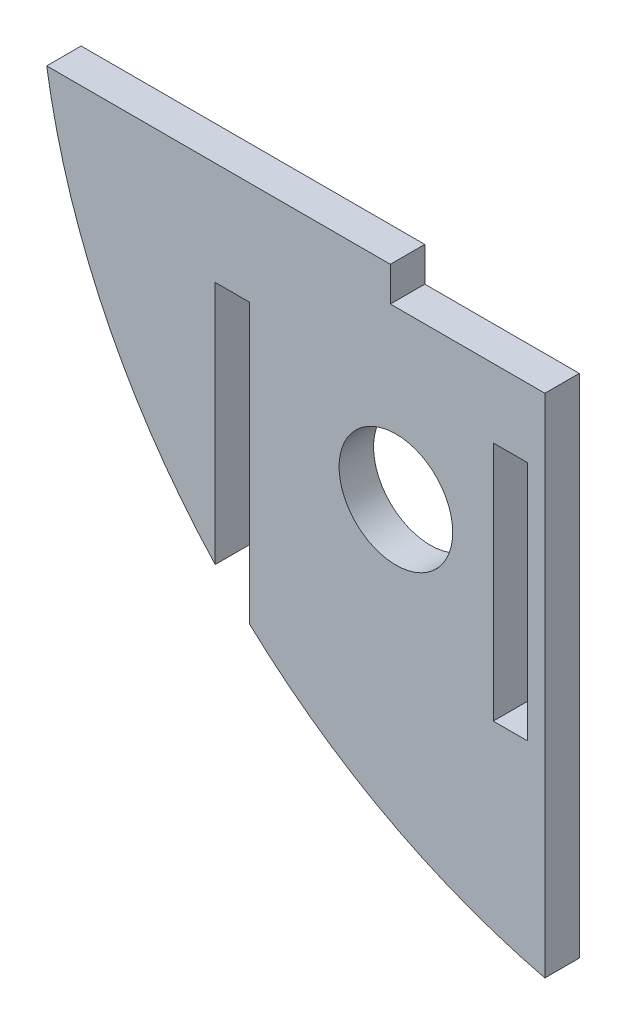
ISO-10303-21;
HEADER;
FILE_DESCRIPTION(('STEP AP214'),'2;1');
FILE_NAME('part.step','',(''),(''),'','','');
FILE_SCHEMA(('AUTOMOTIVE_DESIGN { 1 0 10303 214 1 1 1 1 }'));
ENDSEC;
DATA;
#1=APPLICATION_CONTEXT('core data for automotive mechanical design processes');
#2=APPLICATION_PROTOCOL_DEFINITION('international standard','automotive_design',2000,#1);
#3=PRODUCT_CONTEXT('',#1,'mechanical');
#4=PRODUCT('Part','Part','',(#3));
#5=PRODUCT_RELATED_PRODUCT_CATEGORY('part','',(#4));
#6=PRODUCT_DEFINITION_FORMATION('','',#4);
#7=PRODUCT_DEFINITION_CONTEXT('part definition',#1,'design');
#8=PRODUCT_DEFINITION('design','',#6,#7);
#9=PRODUCT_DEFINITION_SHAPE('','',#8);
#10=(LENGTH_UNIT() NAMED_UNIT(*) SI_UNIT(.MILLI.,.METRE.));
#11=(NAMED_UNIT(*) PLANE_ANGLE_UNIT() SI_UNIT($,.RADIAN.));
#12=(NAMED_UNIT(*) SI_UNIT($,.STERADIAN.) SOLID_ANGLE_UNIT());
#13=UNCERTAINTY_MEASURE_WITH_UNIT(LENGTH_MEASURE(1.E-05),#10,'distance_accuracy_value','');
#14=(GEOMETRIC_REPRESENTATION_CONTEXT(3) GLOBAL_UNCERTAINTY_ASSIGNED_CONTEXT((#13)) GLOBAL_UNIT_ASSIGNED_CONTEXT((#10,
#11,#12)) REPRESENTATION_CONTEXT('',''));
#15=CARTESIAN_POINT('',(0.,0.,0.));
#16=DIRECTION('',(0.,0.,1.));
#17=DIRECTION('',(1.,0.,0.));
#18=AXIS2_PLACEMENT_3D('',#15,#16,#17);
#19=CARTESIAN_POINT('',(6.93769018271361,21.6543137833322,2.));
#20=DIRECTION('',(0.,0.,1.));
#21=DIRECTION('',(1.,0.,0.));
#22=AXIS2_PLACEMENT_3D('',#19,#20,#21);
#23=PLANE('',#22);
#24=CARTESIAN_POINT('',(-10.7533590556281,4.0363965742915,2.));
#25=DIRECTION('',(0.,0.,1.));
#26=DIRECTION('',(1.,0.,0.));
#27=AXIS2_PLACEMENT_3D('',#24,#25,#26);
#28=CIRCLE('',#27,3.3);
#29=CARTESIAN_POINT('',(-7.45335905562809,4.0363965742915,2.));
#30=VERTEX_POINT('',#29);
#31=EDGE_CURVE('E163',#30,#30,#28,.T.);
#32=ORIENTED_EDGE('',*,*,#31,.F.);
#33=EDGE_LOOP('',(#32));
#34=FACE_BOUND('',#33,.T.);
#35=DIRECTION('',(1.,0.,0.));
#36=VECTOR('',#35,1.);
#37=CARTESIAN_POINT('',(-19.2533590556282,9.71406610395515,2.));
#38=LINE('',#37,#36);
#39=CARTESIAN_POINT('',(-21.2533590556282,9.71406610395515,2.));
#40=VERTEX_POINT('',#39);
#41=CARTESIAN_POINT('',(-19.2533590556282,9.71406610395515,2.));
#42=VERTEX_POINT('',#41);
#43=EDGE_CURVE('E169',#40,#42,#38,.T.);
#44=ORIENTED_EDGE('',*,*,#43,.T.);
#45=DIRECTION('',(0.,-1.,0.));
#46=VECTOR('',#45,1.);
#47=CARTESIAN_POINT('',(-19.2533590556282,9.71406610395515,2.));
#48=LINE('',#47,#46);
#49=CARTESIAN_POINT('',(-19.2533590556282,-6.48909148240628,2.));
#50=VERTEX_POINT('',#49);
#51=EDGE_CURVE('E172',#42,#50,#48,.T.);
#52=ORIENTED_EDGE('',*,*,#51,.T.);
#53=CARTESIAN_POINT('',(6.93769018271361,21.6543137833322,2.));
#54=DIRECTION('',(0.,0.,1.));
#55=DIRECTION('',(1.,0.,0.));
#56=AXIS2_PLACEMENT_3D('',#53,#54,#55);
#57=CIRCLE('',#56,38.4450558610186);
#58=CARTESIAN_POINT('',(-2.09704859359963,-15.7140661039551,2.));
#59=VERTEX_POINT('',#58);
#60=EDGE_CURVE('E175',#50,#59,#57,.T.);
#61=ORIENTED_EDGE('',*,*,#60,.T.);
#62=DIRECTION('',(0.,1.,0.));
#63=VECTOR('',#62,1.);
#64=CARTESIAN_POINT('',(-2.0970485935996,-15.7140661039551,2.));
#65=LINE('',#64,#63);
#66=CARTESIAN_POINT('',(-2.0970485935996,13.7140661039551,2.));
#67=VERTEX_POINT('',#66);
#68=EDGE_CURVE('E177',#59,#67,#65,.T.);
#69=ORIENTED_EDGE('',*,*,#68,.T.);
#70=DIRECTION('',(-1.,0.,0.));
#71=VECTOR('',#70,1.);
#72=CARTESIAN_POINT('',(-11.0756895259615,13.7140661039551,2.));
#73=LINE('',#72,#71);
#74=CARTESIAN_POINT('',(-11.0756895259615,13.7140661039551,2.));
#75=VERTEX_POINT('',#74);
#76=EDGE_CURVE('E179',#67,#75,#73,.T.);
#77=ORIENTED_EDGE('',*,*,#76,.T.);
#78=DIRECTION('',(0.,1.,0.));
#79=VECTOR('',#78,1.);
#80=CARTESIAN_POINT('',(-11.0756895259615,13.7140661039551,2.));
#81=LINE('',#80,#79);
#82=CARTESIAN_POINT('',(-11.0756895259615,15.7140661039551,2.));
#83=VERTEX_POINT('',#82);
#84=EDGE_CURVE('E181',#75,#83,#81,.T.);
#85=ORIENTED_EDGE('',*,*,#84,.T.);
#86=DIRECTION('',(-1.,0.,0.));
#87=VECTOR('',#86,1.);
#88=CARTESIAN_POINT('',(-11.0756895259615,15.7140661039551,2.));
#89=LINE('',#88,#87);
#90=CARTESIAN_POINT('',(-31.0456716703991,15.7140661039551,2.));
#91=VERTEX_POINT('',#90);
#92=EDGE_CURVE('E183',#83,#91,#89,.T.);
#93=ORIENTED_EDGE('',*,*,#92,.T.);
#94=CARTESIAN_POINT('',(6.93769018271361,21.6543137833322,2.));
#95=DIRECTION('',(0.,0.,1.));
#96=DIRECTION('',(1.,0.,0.));
#97=AXIS2_PLACEMENT_3D('',#94,#95,#96);
#98=CIRCLE('',#97,38.4450558610186);
#99=CARTESIAN_POINT('',(-21.2533590556282,-4.48544641063722,2.));
#100=VERTEX_POINT('',#99);
#101=EDGE_CURVE('E185',#91,#100,#98,.T.);
#102=ORIENTED_EDGE('',*,*,#101,.T.);
#103=DIRECTION('',(0.,1.,0.));
#104=VECTOR('',#103,1.);
#105=CARTESIAN_POINT('',(-21.2533590556282,9.71406610395515,2.));
#106=LINE('',#105,#104);
#107=EDGE_CURVE('E187',#100,#40,#106,.T.);
#108=ORIENTED_EDGE('',*,*,#107,.T.);
#109=EDGE_LOOP('',(#44,#52,#61,#69,#77,#85,#93,#102,#108));
#110=FACE_BOUND('',#109,.T.);
#111=DIRECTION('',(0.,-1.,0.));
#112=VECTOR('',#111,1.);
#113=CARTESIAN_POINT('',(-5.09704859360113,-4.28593389604486,2.));
#114=LINE('',#113,#112);
#115=CARTESIAN_POINT('',(-5.09704859360113,9.71406610395515,2.));
#116=VERTEX_POINT('',#115);
#117=CARTESIAN_POINT('',(-5.09704859360113,-4.28593389604486,2.));
#118=VERTEX_POINT('',#117);
#119=EDGE_CURVE('E135',#116,#118,#114,.T.);
#120=ORIENTED_EDGE('',*,*,#119,.F.);
#121=DIRECTION('',(-1.,0.,0.));
#122=VECTOR('',#121,1.);
#123=CARTESIAN_POINT('',(-3.09704859360113,9.71406610395515,2.));
#124=LINE('',#123,#122);
#125=CARTESIAN_POINT('',(-3.09704859360113,9.71406610395515,2.));
#126=VERTEX_POINT('',#125);
#127=EDGE_CURVE('E127',#126,#116,#124,.T.);
#128=ORIENTED_EDGE('',*,*,#127,.F.);
#129=DIRECTION('',(0.,1.,0.));
#130=VECTOR('',#129,1.);
#131=CARTESIAN_POINT('',(-3.09704859360113,-4.28593389604486,2.));
#132=LINE('',#131,#130);
#133=CARTESIAN_POINT('',(-3.09704859360113,-4.28593389604486,2.));
#134=VERTEX_POINT('',#133);
#135=EDGE_CURVE('E149',#134,#126,#132,.T.);
#136=ORIENTED_EDGE('',*,*,#135,.F.);
#137=DIRECTION('',(1.,0.,0.));
#138=VECTOR('',#137,1.);
#139=CARTESIAN_POINT('',(-5.09704859360113,-4.28593389604486,2.));
#140=LINE('',#139,#138);
#141=EDGE_CURVE('E147',#118,#134,#140,.T.);
#142=ORIENTED_EDGE('',*,*,#141,.F.);
#143=EDGE_LOOP('',(#120,#128,#136,#142));
#144=FACE_BOUND('',#143,.T.);
#145=ADVANCED_FACE('F32',(#34,#110,#144),#23,.T.);
#146=CARTESIAN_POINT('',(6.93769018271361,21.6543137833322,0.));
#147=DIRECTION('',(0.,0.,1.));
#148=DIRECTION('',(1.,0.,0.));
#149=AXIS2_PLACEMENT_3D('',#146,#147,#148);
#150=PLANE('',#149);
#151=CARTESIAN_POINT('',(-10.7533590556281,4.0363965742915,0.));
#152=DIRECTION('',(0.,0.,1.));
#153=DIRECTION('',(1.,0.,0.));
#154=AXIS2_PLACEMENT_3D('',#151,#152,#153);
#155=CIRCLE('',#154,3.3);
#156=CARTESIAN_POINT('',(-7.45335905562809,4.0363965742915,0.));
#157=VERTEX_POINT('',#156);
#158=EDGE_CURVE('E143',#157,#157,#155,.T.);
#159=ORIENTED_EDGE('',*,*,#158,.T.);
#160=EDGE_LOOP('',(#159));
#161=FACE_BOUND('',#160,.T.);
#162=DIRECTION('',(1.,0.,0.));
#163=VECTOR('',#162,1.);
#164=CARTESIAN_POINT('',(-19.2533590556282,9.71406610395515,0.));
#165=LINE('',#164,#163);
#166=CARTESIAN_POINT('',(-21.2533590556282,9.71406610395515,0.));
#167=VERTEX_POINT('',#166);
#168=CARTESIAN_POINT('',(-19.2533590556282,9.71406610395515,0.));
#169=VERTEX_POINT('',#168);
#170=EDGE_CURVE('E166',#167,#169,#165,.T.);
#171=ORIENTED_EDGE('',*,*,#170,.F.);
#172=DIRECTION('',(0.,1.,0.));
#173=VECTOR('',#172,1.);
#174=CARTESIAN_POINT('',(-21.2533590556282,9.71406610395515,0.));
#175=LINE('',#174,#173);
#176=CARTESIAN_POINT('',(-21.2533590556282,-4.48544641063722,0.));
#177=VERTEX_POINT('',#176);
#178=EDGE_CURVE('E173',#177,#167,#175,.T.);
#179=ORIENTED_EDGE('',*,*,#178,.F.);
#180=CARTESIAN_POINT('',(6.93769018271361,21.6543137833322,0.));
#181=DIRECTION('',(0.,0.,1.));
#182=DIRECTION('',(1.,0.,0.));
#183=AXIS2_PLACEMENT_3D('',#180,#181,#182);
#184=CIRCLE('',#183,38.4450558610186);
#185=CARTESIAN_POINT('',(-31.0456716703991,15.7140661039551,0.));
#186=VERTEX_POINT('',#185);
#187=EDGE_CURVE('E204',#186,#177,#184,.T.);
#188=ORIENTED_EDGE('',*,*,#187,.F.);
#189=DIRECTION('',(-1.,0.,0.));
#190=VECTOR('',#189,1.);
#191=CARTESIAN_POINT('',(-11.0756895259615,15.7140661039551,0.));
#192=LINE('',#191,#190);
#193=CARTESIAN_POINT('',(-11.0756895259615,15.7140661039551,0.));
#194=VERTEX_POINT('',#193);
#195=EDGE_CURVE('E202',#194,#186,#192,.T.);
#196=ORIENTED_EDGE('',*,*,#195,.F.);
#197=DIRECTION('',(0.,1.,0.));
#198=VECTOR('',#197,1.);
#199=CARTESIAN_POINT('',(-11.0756895259615,13.7140661039551,0.));
#200=LINE('',#199,#198);
#201=CARTESIAN_POINT('',(-11.0756895259615,13.7140661039551,0.));
#202=VERTEX_POINT('',#201);
#203=EDGE_CURVE('E200',#202,#194,#200,.T.);
#204=ORIENTED_EDGE('',*,*,#203,.F.);
#205=DIRECTION('',(-1.,0.,0.));
#206=VECTOR('',#205,1.);
#207=CARTESIAN_POINT('',(-11.0756895259615,13.7140661039551,0.));
#208=LINE('',#207,#206);
#209=CARTESIAN_POINT('',(-2.0970485935996,13.7140661039551,0.));
#210=VERTEX_POINT('',#209);
#211=EDGE_CURVE('E198',#210,#202,#208,.T.);
#212=ORIENTED_EDGE('',*,*,#211,.F.);
#213=DIRECTION('',(0.,1.,0.));
#214=VECTOR('',#213,1.);
#215=CARTESIAN_POINT('',(-2.0970485935996,-15.7140661039551,0.));
#216=LINE('',#215,#214);
#217=CARTESIAN_POINT('',(-2.09704859359963,-15.7140661039551,0.));
#218=VERTEX_POINT('',#217);
#219=EDGE_CURVE('E196',#218,#210,#216,.T.);
#220=ORIENTED_EDGE('',*,*,#219,.F.);
#221=CARTESIAN_POINT('',(6.93769018271361,21.6543137833322,0.));
#222=DIRECTION('',(0.,0.,1.));
#223=DIRECTION('',(1.,0.,0.));
#224=AXIS2_PLACEMENT_3D('',#221,#222,#223);
#225=CIRCLE('',#224,38.4450558610186);
#226=CARTESIAN_POINT('',(-19.2533590556282,-6.48909148240628,0.));
#227=VERTEX_POINT('',#226);
#228=EDGE_CURVE('E194',#227,#218,#225,.T.);
#229=ORIENTED_EDGE('',*,*,#228,.F.);
#230=DIRECTION('',(0.,-1.,0.));
#231=VECTOR('',#230,1.);
#232=CARTESIAN_POINT('',(-19.2533590556282,9.71406610395515,0.));
#233=LINE('',#232,#231);
#234=EDGE_CURVE('E192',#169,#227,#233,.T.);
#235=ORIENTED_EDGE('',*,*,#234,.F.);
#236=EDGE_LOOP('',(#171,#179,#188,#196,#204,#212,#220,#229,#235));
#237=FACE_BOUND('',#236,.T.);
#238=DIRECTION('',(-1.,0.,0.));
#239=VECTOR('',#238,1.);
#240=CARTESIAN_POINT('',(-3.09704859360113,9.71406610395515,0.));
#241=LINE('',#240,#239);
#242=CARTESIAN_POINT('',(-3.09704859360113,9.71406610395515,0.));
#243=VERTEX_POINT('',#242);
#244=CARTESIAN_POINT('',(-5.09704859360113,9.71406610395515,0.));
#245=VERTEX_POINT('',#244);
#246=EDGE_CURVE('E55',#243,#245,#241,.T.);
#247=ORIENTED_EDGE('',*,*,#246,.T.);
#248=DIRECTION('',(0.,-1.,0.));
#249=VECTOR('',#248,1.);
#250=CARTESIAN_POINT('',(-5.09704859360113,-4.28593389604486,0.));
#251=LINE('',#250,#249);
#252=CARTESIAN_POINT('',(-5.09704859360113,-4.28593389604486,0.));
#253=VERTEX_POINT('',#252);
#254=EDGE_CURVE('E142',#245,#253,#251,.T.);
#255=ORIENTED_EDGE('',*,*,#254,.T.);
#256=DIRECTION('',(1.,0.,0.));
#257=VECTOR('',#256,1.);
#258=CARTESIAN_POINT('',(-5.09704859360113,-4.28593389604486,0.));
#259=LINE('',#258,#257);
#260=CARTESIAN_POINT('',(-3.09704859360113,-4.28593389604486,0.));
#261=VERTEX_POINT('',#260);
#262=EDGE_CURVE('E155',#253,#261,#259,.T.);
#263=ORIENTED_EDGE('',*,*,#262,.T.);
#264=DIRECTION('',(0.,1.,0.));
#265=VECTOR('',#264,1.);
#266=CARTESIAN_POINT('',(-3.09704859360113,-4.28593389604486,0.));
#267=LINE('',#266,#265);
#268=EDGE_CURVE('E136',#261,#243,#267,.T.);
#269=ORIENTED_EDGE('',*,*,#268,.T.);
#270=EDGE_LOOP('',(#247,#255,#263,#269));
#271=FACE_BOUND('',#270,.T.);
#272=ADVANCED_FACE('F237',(#161,#237,#271),#150,.F.);
#273=CARTESIAN_POINT('',(-19.2533590556282,9.71406610395515,2.));
#274=DIRECTION('',(0.,1.,0.));
#275=DIRECTION('',(0.,0.,1.));
#276=AXIS2_PLACEMENT_3D('',#273,#274,#275);
#277=PLANE('',#276);
#278=ORIENTED_EDGE('',*,*,#170,.T.);
#279=DIRECTION('',(0.,0.,-1.));
#280=VECTOR('',#279,1.);
#281=CARTESIAN_POINT('',(-19.2533590556282,9.71406610395515,2.));
#282=LINE('',#281,#280);
#283=EDGE_CURVE('E11',#42,#169,#282,.T.);
#284=ORIENTED_EDGE('',*,*,#283,.F.);
#285=ORIENTED_EDGE('',*,*,#43,.F.);
#286=DIRECTION('',(0.,0.,-1.));
#287=VECTOR('',#286,1.);
#288=CARTESIAN_POINT('',(-21.2533590556282,9.71406610395515,2.));
#289=LINE('',#288,#287);
#290=EDGE_CURVE('E189',#40,#167,#289,.T.);
#291=ORIENTED_EDGE('',*,*,#290,.T.);
#292=EDGE_LOOP('',(#278,#284,#285,#291));
#293=FACE_BOUND('',#292,.T.);
#294=ADVANCED_FACE('F34',(#293),#277,.F.);
#295=CARTESIAN_POINT('',(-19.2533590556282,9.71406610395515,2.));
#296=DIRECTION('',(1.,0.,0.));
#297=DIRECTION('',(0.,0.,-1.));
#298=AXIS2_PLACEMENT_3D('',#295,#296,#297);
#299=PLANE('',#298);
#300=ORIENTED_EDGE('',*,*,#234,.T.);
#301=DIRECTION('',(0.,0.,-1.));
#302=VECTOR('',#301,1.);
#303=CARTESIAN_POINT('',(-19.2533590556282,-6.48909148240628,2.));
#304=LINE('',#303,#302);
#305=EDGE_CURVE('E40',#50,#227,#304,.T.);
#306=ORIENTED_EDGE('',*,*,#305,.F.);
#307=ORIENTED_EDGE('',*,*,#51,.F.);
#308=ORIENTED_EDGE('',*,*,#283,.T.);
#309=EDGE_LOOP('',(#300,#306,#307,#308));
#310=FACE_BOUND('',#309,.T.);
#311=ADVANCED_FACE('F254',(#310),#299,.F.);
#312=CARTESIAN_POINT('',(6.93769018271361,21.6543137833322,2.));
#313=DIRECTION('',(0.,0.,-1.));
#314=DIRECTION('',(-1.,0.,0.));
#315=AXIS2_PLACEMENT_3D('',#312,#313,#314);
#316=CYLINDRICAL_SURFACE('',#315,38.4450558610186);
#317=ORIENTED_EDGE('',*,*,#228,.T.);
#318=DIRECTION('',(0.,0.,-1.));
#319=VECTOR('',#318,1.);
#320=CARTESIAN_POINT('',(-2.09704859359963,-15.7140661039551,2.));
#321=LINE('',#320,#319);
#322=EDGE_CURVE('E224',#59,#218,#321,.T.);
#323=ORIENTED_EDGE('',*,*,#322,.F.);
#324=ORIENTED_EDGE('',*,*,#60,.F.);
#325=ORIENTED_EDGE('',*,*,#305,.T.);
#326=EDGE_LOOP('',(#317,#323,#324,#325));
#327=FACE_BOUND('',#326,.T.);
#328=ADVANCED_FACE('F231',(#327),#316,.T.);
#329=CARTESIAN_POINT('',(-2.0970485935996,-15.7140661039551,2.));
#330=DIRECTION('',(-1.,0.,0.));
#331=DIRECTION('',(0.,0.,1.));
#332=AXIS2_PLACEMENT_3D('',#329,#330,#331);
#333=PLANE('',#332);
#334=ORIENTED_EDGE('',*,*,#219,.T.);
#335=DIRECTION('',(0.,0.,-1.));
#336=VECTOR('',#335,1.);
#337=CARTESIAN_POINT('',(-2.0970485935996,13.7140661039551,2.));
#338=LINE('',#337,#336);
#339=EDGE_CURVE('E221',#67,#210,#338,.T.);
#340=ORIENTED_EDGE('',*,*,#339,.F.);
#341=ORIENTED_EDGE('',*,*,#68,.F.);
#342=ORIENTED_EDGE('',*,*,#322,.T.);
#343=EDGE_LOOP('',(#334,#340,#341,#342));
#344=FACE_BOUND('',#343,.T.);
#345=ADVANCED_FACE('F243',(#344),#333,.F.);
#346=CARTESIAN_POINT('',(-11.0756895259615,13.7140661039551,2.));
#347=DIRECTION('',(0.,-1.,0.));
#348=DIRECTION('',(0.,0.,-1.));
#349=AXIS2_PLACEMENT_3D('',#346,#347,#348);
#350=PLANE('',#349);
#351=ORIENTED_EDGE('',*,*,#211,.T.);
#352=DIRECTION('',(0.,0.,-1.));
#353=VECTOR('',#352,1.);
#354=CARTESIAN_POINT('',(-11.0756895259615,13.7140661039551,2.));
#355=LINE('',#354,#353);
#356=EDGE_CURVE('E218',#75,#202,#355,.T.);
#357=ORIENTED_EDGE('',*,*,#356,.F.);
#358=ORIENTED_EDGE('',*,*,#76,.F.);
#359=ORIENTED_EDGE('',*,*,#339,.T.);
#360=EDGE_LOOP('',(#351,#357,#358,#359));
#361=FACE_BOUND('',#360,.T.);
#362=ADVANCED_FACE('F247',(#361),#350,.F.);
#363=CARTESIAN_POINT('',(-11.0756895259615,13.7140661039551,2.));
#364=DIRECTION('',(-1.,0.,0.));
#365=DIRECTION('',(0.,0.,1.));
#366=AXIS2_PLACEMENT_3D('',#363,#364,#365);
#367=PLANE('',#366);
#368=ORIENTED_EDGE('',*,*,#203,.T.);
#369=DIRECTION('',(0.,0.,-1.));
#370=VECTOR('',#369,1.);
#371=CARTESIAN_POINT('',(-11.0756895259615,15.7140661039551,2.));
#372=LINE('',#371,#370);
#373=EDGE_CURVE('E215',#83,#194,#372,.T.);
#374=ORIENTED_EDGE('',*,*,#373,.F.);
#375=ORIENTED_EDGE('',*,*,#84,.F.);
#376=ORIENTED_EDGE('',*,*,#356,.T.);
#377=EDGE_LOOP('',(#368,#374,#375,#376));
#378=FACE_BOUND('',#377,.T.);
#379=ADVANCED_FACE('F272',(#378),#367,.F.);
#380=CARTESIAN_POINT('',(-11.0756895259615,15.7140661039551,2.));
#381=DIRECTION('',(0.,-1.,0.));
#382=DIRECTION('',(0.,0.,-1.));
#383=AXIS2_PLACEMENT_3D('',#380,#381,#382);
#384=PLANE('',#383);
#385=ORIENTED_EDGE('',*,*,#195,.T.);
#386=DIRECTION('',(0.,0.,-1.));
#387=VECTOR('',#386,1.);
#388=CARTESIAN_POINT('',(-31.0456716703991,15.7140661039551,2.));
#389=LINE('',#388,#387);
#390=EDGE_CURVE('E212',#91,#186,#389,.T.);
#391=ORIENTED_EDGE('',*,*,#390,.F.);
#392=ORIENTED_EDGE('',*,*,#92,.F.);
#393=ORIENTED_EDGE('',*,*,#373,.T.);
#394=EDGE_LOOP('',(#385,#391,#392,#393));
#395=FACE_BOUND('',#394,.T.);
#396=ADVANCED_FACE('F270',(#395),#384,.F.);
#397=CARTESIAN_POINT('',(6.93769018271361,21.6543137833322,2.));
#398=DIRECTION('',(0.,0.,-1.));
#399=DIRECTION('',(-1.,0.,0.));
#400=AXIS2_PLACEMENT_3D('',#397,#398,#399);
#401=CYLINDRICAL_SURFACE('',#400,38.4450558610186);
#402=ORIENTED_EDGE('',*,*,#187,.T.);
#403=DIRECTION('',(0.,0.,-1.));
#404=VECTOR('',#403,1.);
#405=CARTESIAN_POINT('',(-21.2533590556282,-4.48544641063722,2.));
#406=LINE('',#405,#404);
#407=EDGE_CURVE('E209',#100,#177,#406,.T.);
#408=ORIENTED_EDGE('',*,*,#407,.F.);
#409=ORIENTED_EDGE('',*,*,#101,.F.);
#410=ORIENTED_EDGE('',*,*,#390,.T.);
#411=EDGE_LOOP('',(#402,#408,#409,#410));
#412=FACE_BOUND('',#411,.T.);
#413=ADVANCED_FACE('F266',(#412),#401,.T.);
#414=CARTESIAN_POINT('',(-21.2533590556282,9.71406610395515,2.));
#415=DIRECTION('',(-1.,0.,0.));
#416=DIRECTION('',(0.,0.,1.));
#417=AXIS2_PLACEMENT_3D('',#414,#415,#416);
#418=PLANE('',#417);
#419=ORIENTED_EDGE('',*,*,#178,.T.);
#420=ORIENTED_EDGE('',*,*,#290,.F.);
#421=ORIENTED_EDGE('',*,*,#107,.F.);
#422=ORIENTED_EDGE('',*,*,#407,.T.);
#423=EDGE_LOOP('',(#419,#420,#421,#422));
#424=FACE_BOUND('',#423,.T.);
#425=ADVANCED_FACE('F261',(#424),#418,.F.);
#426=CARTESIAN_POINT('',(-10.7533590556281,4.0363965742915,2.));
#427=DIRECTION('',(0.,0.,-1.));
#428=DIRECTION('',(-1.,0.,0.));
#429=AXIS2_PLACEMENT_3D('',#426,#427,#428);
#430=CYLINDRICAL_SURFACE('',#429,3.3);
#431=ORIENTED_EDGE('',*,*,#31,.T.);
#432=EDGE_LOOP('',(#431));
#433=FACE_BOUND('',#432,.T.);
#434=ORIENTED_EDGE('',*,*,#158,.F.);
#435=EDGE_LOOP('',(#434));
#436=FACE_BOUND('',#435,.T.);
#437=ADVANCED_FACE('F291',(#433,#436),#430,.F.);
#438=CARTESIAN_POINT('',(-3.09704859360113,9.71406610395515,2.));
#439=DIRECTION('',(0.,-1.,0.));
#440=DIRECTION('',(0.,0.,-1.));
#441=AXIS2_PLACEMENT_3D('',#438,#439,#440);
#442=PLANE('',#441);
#443=ORIENTED_EDGE('',*,*,#246,.F.);
#444=DIRECTION('',(0.,0.,-1.));
#445=VECTOR('',#444,1.);
#446=CARTESIAN_POINT('',(-3.09704859360113,9.71406610395515,2.));
#447=LINE('',#446,#445);
#448=EDGE_CURVE('E131',#126,#243,#447,.T.);
#449=ORIENTED_EDGE('',*,*,#448,.F.);
#450=ORIENTED_EDGE('',*,*,#127,.T.);
#451=DIRECTION('',(0.,0.,-1.));
#452=VECTOR('',#451,1.);
#453=CARTESIAN_POINT('',(-5.09704859360113,9.71406610395515,2.));
#454=LINE('',#453,#452);
#455=EDGE_CURVE('E130',#116,#245,#454,.T.);
#456=ORIENTED_EDGE('',*,*,#455,.T.);
#457=EDGE_LOOP('',(#443,#449,#450,#456));
#458=FACE_BOUND('',#457,.T.);
#459=ADVANCED_FACE('F129',(#458),#442,.T.);
#460=CARTESIAN_POINT('',(-5.09704859360113,-4.28593389604486,2.));
#461=DIRECTION('',(1.,0.,0.));
#462=DIRECTION('',(0.,0.,-1.));
#463=AXIS2_PLACEMENT_3D('',#460,#461,#462);
#464=PLANE('',#463);
#465=ORIENTED_EDGE('',*,*,#254,.F.);
#466=ORIENTED_EDGE('',*,*,#455,.F.);
#467=ORIENTED_EDGE('',*,*,#119,.T.);
#468=DIRECTION('',(0.,0.,-1.));
#469=VECTOR('',#468,1.);
#470=CARTESIAN_POINT('',(-5.09704859360113,-4.28593389604486,2.));
#471=LINE('',#470,#469);
#472=EDGE_CURVE('E144',#118,#253,#471,.T.);
#473=ORIENTED_EDGE('',*,*,#472,.T.);
#474=EDGE_LOOP('',(#465,#466,#467,#473));
#475=FACE_BOUND('',#474,.T.);
#476=ADVANCED_FACE('F139',(#475),#464,.T.);
#477=CARTESIAN_POINT('',(-5.09704859360113,-4.28593389604486,2.));
#478=DIRECTION('',(0.,1.,0.));
#479=DIRECTION('',(0.,0.,1.));
#480=AXIS2_PLACEMENT_3D('',#477,#478,#479);
#481=PLANE('',#480);
#482=ORIENTED_EDGE('',*,*,#262,.F.);
#483=ORIENTED_EDGE('',*,*,#472,.F.);
#484=ORIENTED_EDGE('',*,*,#141,.T.);
#485=DIRECTION('',(0.,0.,-1.));
#486=VECTOR('',#485,1.);
#487=CARTESIAN_POINT('',(-3.09704859360113,-4.28593389604486,2.));
#488=LINE('',#487,#486);
#489=EDGE_CURVE('E47',#134,#261,#488,.T.);
#490=ORIENTED_EDGE('',*,*,#489,.T.);
#491=EDGE_LOOP('',(#482,#483,#484,#490));
#492=FACE_BOUND('',#491,.T.);
#493=ADVANCED_FACE('F322',(#492),#481,.T.);
#494=CARTESIAN_POINT('',(-3.09704859360113,-4.28593389604486,2.));
#495=DIRECTION('',(-1.,0.,0.));
#496=DIRECTION('',(0.,0.,1.));
#497=AXIS2_PLACEMENT_3D('',#494,#495,#496);
#498=PLANE('',#497);
#499=ORIENTED_EDGE('',*,*,#268,.F.);
#500=ORIENTED_EDGE('',*,*,#489,.F.);
#501=ORIENTED_EDGE('',*,*,#135,.T.);
#502=ORIENTED_EDGE('',*,*,#448,.T.);
#503=EDGE_LOOP('',(#499,#500,#501,#502));
#504=FACE_BOUND('',#503,.T.);
#505=ADVANCED_FACE('F329',(#504),#498,.T.);
#506=CLOSED_SHELL('',(#145,#272,#294,#311,#328,#345,#362,#379,#396,#413,#425,#437,#459,#476,
#493,#505));
#507=MANIFOLD_SOLID_BREP('B2',#506);
#508=ADVANCED_BREP_SHAPE_REPRESENTATION('',(#18,#507),#14);
#509=SHAPE_DEFINITION_REPRESENTATION(#9,#508);
ENDSEC;
END-ISO-10303-21;
